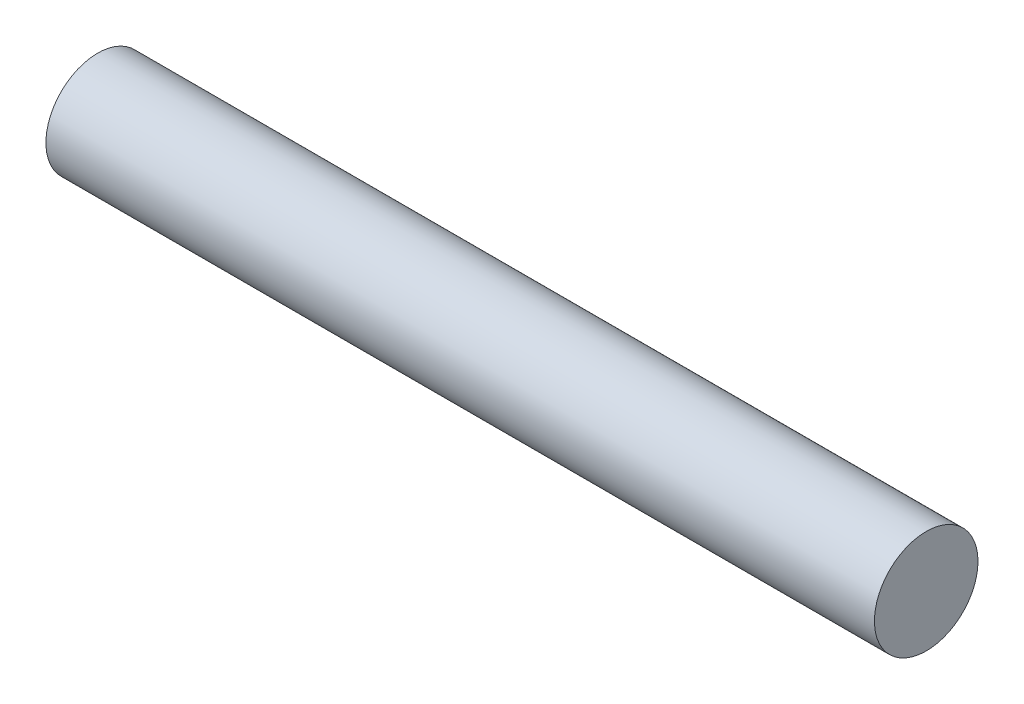
ISO-10303-21;
HEADER;
FILE_DESCRIPTION(('STEP AP214'),'2;1');
FILE_NAME('part.step','',(''),(''),'','','');
FILE_SCHEMA(('AUTOMOTIVE_DESIGN { 1 0 10303 214 1 1 1 1 }'));
ENDSEC;
DATA;
#1=APPLICATION_CONTEXT('core data for automotive mechanical design processes');
#2=APPLICATION_PROTOCOL_DEFINITION('international standard','automotive_design',2000,#1);
#3=PRODUCT_CONTEXT('',#1,'mechanical');
#4=PRODUCT('Part','Part','',(#3));
#5=PRODUCT_RELATED_PRODUCT_CATEGORY('part','',(#4));
#6=PRODUCT_DEFINITION_FORMATION('','',#4);
#7=PRODUCT_DEFINITION_CONTEXT('part definition',#1,'design');
#8=PRODUCT_DEFINITION('design','',#6,#7);
#9=PRODUCT_DEFINITION_SHAPE('','',#8);
#10=(LENGTH_UNIT() NAMED_UNIT(*) SI_UNIT(.MILLI.,.METRE.));
#11=(NAMED_UNIT(*) PLANE_ANGLE_UNIT() SI_UNIT($,.RADIAN.));
#12=(NAMED_UNIT(*) SI_UNIT($,.STERADIAN.) SOLID_ANGLE_UNIT());
#13=UNCERTAINTY_MEASURE_WITH_UNIT(LENGTH_MEASURE(1.E-05),#10,'distance_accuracy_value','');
#14=(GEOMETRIC_REPRESENTATION_CONTEXT(3) GLOBAL_UNCERTAINTY_ASSIGNED_CONTEXT((#13)) GLOBAL_UNIT_ASSIGNED_CONTEXT((#10,
#11,#12)) REPRESENTATION_CONTEXT('',''));
#15=CARTESIAN_POINT('',(0.,0.,0.));
#16=DIRECTION('',(0.,0.,1.));
#17=DIRECTION('',(1.,0.,0.));
#18=AXIS2_PLACEMENT_3D('',#15,#16,#17);
#19=CARTESIAN_POINT('',(80.,0.,0.));
#20=DIRECTION('',(-1.,0.,0.));
#21=DIRECTION('',(0.,0.,1.));
#22=AXIS2_PLACEMENT_3D('',#19,#20,#21);
#23=CYLINDRICAL_SURFACE('',#22,5.);
#24=CARTESIAN_POINT('',(80.,0.,0.));
#25=DIRECTION('',(1.,0.,0.));
#26=DIRECTION('',(0.,0.,-1.));
#27=AXIS2_PLACEMENT_3D('',#24,#25,#26);
#28=CIRCLE('',#27,5.);
#29=CARTESIAN_POINT('',(80.,0.,-5.));
#30=VERTEX_POINT('',#29);
#31=EDGE_CURVE('E10',#30,#30,#28,.T.);
#32=ORIENTED_EDGE('',*,*,#31,.F.);
#33=EDGE_LOOP('',(#32));
#34=FACE_BOUND('',#33,.T.);
#35=CARTESIAN_POINT('',(0.,0.,0.));
#36=DIRECTION('',(1.,0.,0.));
#37=DIRECTION('',(0.,0.,-1.));
#38=AXIS2_PLACEMENT_3D('',#35,#36,#37);
#39=CIRCLE('',#38,5.);
#40=CARTESIAN_POINT('',(0.,0.,-5.));
#41=VERTEX_POINT('',#40);
#42=EDGE_CURVE('E34',#41,#41,#39,.T.);
#43=ORIENTED_EDGE('',*,*,#42,.T.);
#44=EDGE_LOOP('',(#43));
#45=FACE_BOUND('',#44,.T.);
#46=ADVANCED_FACE('F31',(#34,#45),#23,.T.);
#47=CARTESIAN_POINT('',(80.,0.,0.));
#48=DIRECTION('',(1.,0.,0.));
#49=DIRECTION('',(0.,0.,-1.));
#50=AXIS2_PLACEMENT_3D('',#47,#48,#49);
#51=PLANE('',#50);
#52=ORIENTED_EDGE('',*,*,#31,.T.);
#53=EDGE_LOOP('',(#52));
#54=FACE_BOUND('',#53,.T.);
#55=ADVANCED_FACE('F46',(#54),#51,.T.);
#56=CARTESIAN_POINT('',(0.,0.,0.));
#57=DIRECTION('',(1.,0.,0.));
#58=DIRECTION('',(0.,0.,-1.));
#59=AXIS2_PLACEMENT_3D('',#56,#57,#58);
#60=PLANE('',#59);
#61=ORIENTED_EDGE('',*,*,#42,.F.);
#62=EDGE_LOOP('',(#61));
#63=FACE_BOUND('',#62,.T.);
#64=ADVANCED_FACE('F44',(#63),#60,.F.);
#65=CLOSED_SHELL('',(#46,#55,#64));
#66=MANIFOLD_SOLID_BREP('B2',#65);
#67=ADVANCED_BREP_SHAPE_REPRESENTATION('',(#18,#66),#14);
#68=SHAPE_DEFINITION_REPRESENTATION(#9,#67);
ENDSEC;
END-ISO-10303-21;
